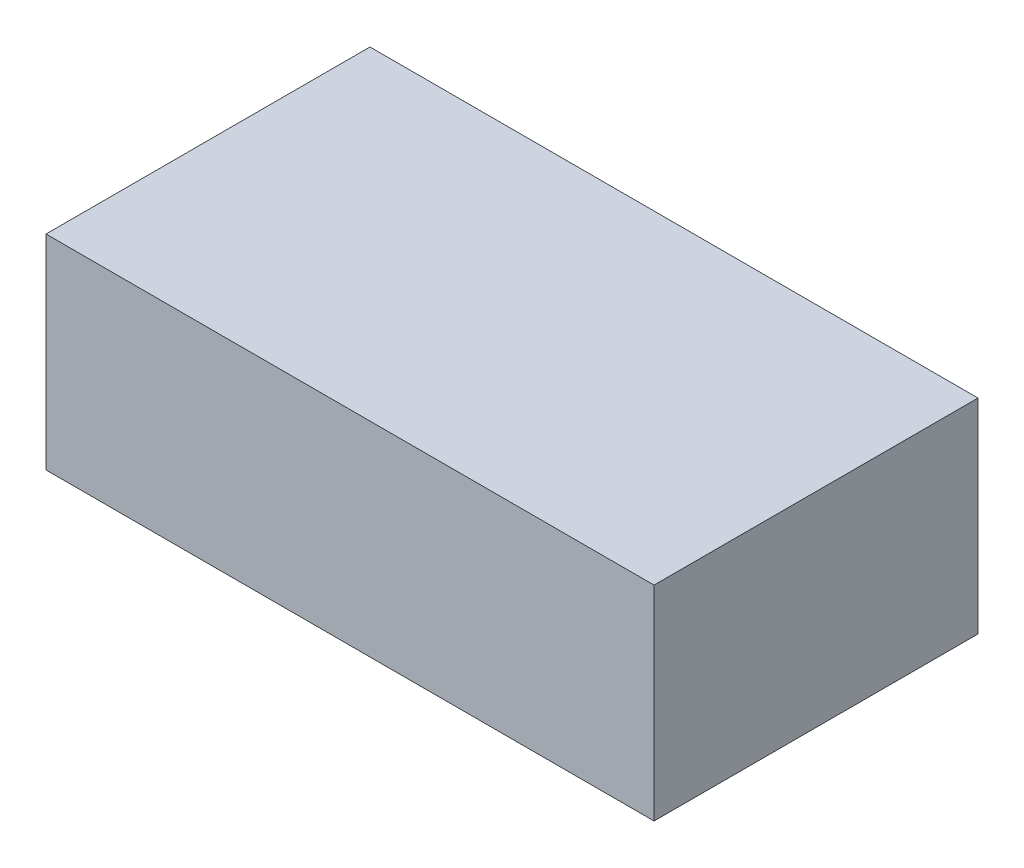
ISO-10303-21;
HEADER;
FILE_DESCRIPTION(('STEP AP214'),'2;1');
FILE_NAME('part.step','',(''),(''),'','','');
FILE_SCHEMA(('AUTOMOTIVE_DESIGN { 1 0 10303 214 1 1 1 1 }'));
ENDSEC;
DATA;
#1=APPLICATION_CONTEXT('core data for automotive mechanical design processes');
#2=APPLICATION_PROTOCOL_DEFINITION('international standard','automotive_design',2000,#1);
#3=PRODUCT_CONTEXT('',#1,'mechanical');
#4=PRODUCT('Part','Part','',(#3));
#5=PRODUCT_RELATED_PRODUCT_CATEGORY('part','',(#4));
#6=PRODUCT_DEFINITION_FORMATION('','',#4);
#7=PRODUCT_DEFINITION_CONTEXT('part definition',#1,'design');
#8=PRODUCT_DEFINITION('design','',#6,#7);
#9=PRODUCT_DEFINITION_SHAPE('','',#8);
#10=(LENGTH_UNIT() NAMED_UNIT(*) SI_UNIT(.MILLI.,.METRE.));
#11=(NAMED_UNIT(*) PLANE_ANGLE_UNIT() SI_UNIT($,.RADIAN.));
#12=(NAMED_UNIT(*) SI_UNIT($,.STERADIAN.) SOLID_ANGLE_UNIT());
#13=UNCERTAINTY_MEASURE_WITH_UNIT(LENGTH_MEASURE(1.E-05),#10,'distance_accuracy_value','');
#14=(GEOMETRIC_REPRESENTATION_CONTEXT(3) GLOBAL_UNCERTAINTY_ASSIGNED_CONTEXT((#13)) GLOBAL_UNIT_ASSIGNED_CONTEXT((#10,
#11,#12)) REPRESENTATION_CONTEXT('',''));
#15=CARTESIAN_POINT('',(0.,0.,0.));
#16=DIRECTION('',(0.,0.,1.));
#17=DIRECTION('',(1.,0.,0.));
#18=AXIS2_PLACEMENT_3D('',#15,#16,#17);
#19=CARTESIAN_POINT('',(61.,41.,-32.5));
#20=DIRECTION('',(-1.,0.,0.));
#21=DIRECTION('',(0.,0.,1.));
#22=AXIS2_PLACEMENT_3D('',#19,#20,#21);
#23=PLANE('',#22);
#24=DIRECTION('',(0.,0.,-1.));
#25=VECTOR('',#24,1.);
#26=CARTESIAN_POINT('',(61.,0.,-32.5));
#27=LINE('',#26,#25);
#28=CARTESIAN_POINT('',(61.,0.,32.5));
#29=VERTEX_POINT('',#28);
#30=CARTESIAN_POINT('',(61.,0.,-32.5));
#31=VERTEX_POINT('',#30);
#32=EDGE_CURVE('E96',#29,#31,#27,.T.);
#33=ORIENTED_EDGE('',*,*,#32,.T.);
#34=DIRECTION('',(0.,-1.,0.));
#35=VECTOR('',#34,1.);
#36=CARTESIAN_POINT('',(61.,41.,-32.5));
#37=LINE('',#36,#35);
#38=CARTESIAN_POINT('',(61.,41.,-32.5));
#39=VERTEX_POINT('',#38);
#40=EDGE_CURVE('E11',#39,#31,#37,.T.);
#41=ORIENTED_EDGE('',*,*,#40,.F.);
#42=DIRECTION('',(0.,0.,-1.));
#43=VECTOR('',#42,1.);
#44=CARTESIAN_POINT('',(61.,41.,-32.5));
#45=LINE('',#44,#43);
#46=CARTESIAN_POINT('',(61.,41.,32.5));
#47=VERTEX_POINT('',#46);
#48=EDGE_CURVE('E84',#47,#39,#45,.T.);
#49=ORIENTED_EDGE('',*,*,#48,.F.);
#50=DIRECTION('',(0.,-1.,0.));
#51=VECTOR('',#50,1.);
#52=CARTESIAN_POINT('',(61.,41.,32.5));
#53=LINE('',#52,#51);
#54=EDGE_CURVE('E92',#47,#29,#53,.T.);
#55=ORIENTED_EDGE('',*,*,#54,.T.);
#56=EDGE_LOOP('',(#33,#41,#49,#55));
#57=FACE_BOUND('',#56,.T.);
#58=ADVANCED_FACE('F33',(#57),#23,.F.);
#59=CARTESIAN_POINT('',(-61.,41.,-32.5));
#60=DIRECTION('',(0.,0.,1.));
#61=DIRECTION('',(1.,0.,0.));
#62=AXIS2_PLACEMENT_3D('',#59,#60,#61);
#63=PLANE('',#62);
#64=DIRECTION('',(-1.,0.,0.));
#65=VECTOR('',#64,1.);
#66=CARTESIAN_POINT('',(-61.,0.,-32.5));
#67=LINE('',#66,#65);
#68=CARTESIAN_POINT('',(-61.,0.,-32.5));
#69=VERTEX_POINT('',#68);
#70=EDGE_CURVE('E88',#31,#69,#67,.T.);
#71=ORIENTED_EDGE('',*,*,#70,.T.);
#72=DIRECTION('',(0.,-1.,0.));
#73=VECTOR('',#72,1.);
#74=CARTESIAN_POINT('',(-61.,41.,-32.5));
#75=LINE('',#74,#73);
#76=CARTESIAN_POINT('',(-61.,41.,-32.5));
#77=VERTEX_POINT('',#76);
#78=EDGE_CURVE('E41',#77,#69,#75,.T.);
#79=ORIENTED_EDGE('',*,*,#78,.F.);
#80=DIRECTION('',(-1.,0.,0.));
#81=VECTOR('',#80,1.);
#82=CARTESIAN_POINT('',(-61.,41.,-32.5));
#83=LINE('',#82,#81);
#84=EDGE_CURVE('E79',#39,#77,#83,.T.);
#85=ORIENTED_EDGE('',*,*,#84,.F.);
#86=ORIENTED_EDGE('',*,*,#40,.T.);
#87=EDGE_LOOP('',(#71,#79,#85,#86));
#88=FACE_BOUND('',#87,.T.);
#89=ADVANCED_FACE('F87',(#88),#63,.F.);
#90=CARTESIAN_POINT('',(-61.,41.,-32.5));
#91=DIRECTION('',(1.,0.,0.));
#92=DIRECTION('',(0.,0.,-1.));
#93=AXIS2_PLACEMENT_3D('',#90,#91,#92);
#94=PLANE('',#93);
#95=DIRECTION('',(0.,0.,1.));
#96=VECTOR('',#95,1.);
#97=CARTESIAN_POINT('',(-61.,0.,-32.5));
#98=LINE('',#97,#96);
#99=CARTESIAN_POINT('',(-61.,0.,32.5));
#100=VERTEX_POINT('',#99);
#101=EDGE_CURVE('E66',#69,#100,#98,.T.);
#102=ORIENTED_EDGE('',*,*,#101,.T.);
#103=DIRECTION('',(0.,-1.,0.));
#104=VECTOR('',#103,1.);
#105=CARTESIAN_POINT('',(-61.,41.,32.5));
#106=LINE('',#105,#104);
#107=CARTESIAN_POINT('',(-61.,41.,32.5));
#108=VERTEX_POINT('',#107);
#109=EDGE_CURVE('E89',#108,#100,#106,.T.);
#110=ORIENTED_EDGE('',*,*,#109,.F.);
#111=DIRECTION('',(0.,0.,1.));
#112=VECTOR('',#111,1.);
#113=CARTESIAN_POINT('',(-61.,41.,-32.5));
#114=LINE('',#113,#112);
#115=EDGE_CURVE('E82',#77,#108,#114,.T.);
#116=ORIENTED_EDGE('',*,*,#115,.F.);
#117=ORIENTED_EDGE('',*,*,#78,.T.);
#118=EDGE_LOOP('',(#102,#110,#116,#117));
#119=FACE_BOUND('',#118,.T.);
#120=ADVANCED_FACE('F90',(#119),#94,.F.);
#121=CARTESIAN_POINT('',(-61.,41.,32.5));
#122=DIRECTION('',(0.,0.,-1.));
#123=DIRECTION('',(-1.,0.,0.));
#124=AXIS2_PLACEMENT_3D('',#121,#122,#123);
#125=PLANE('',#124);
#126=DIRECTION('',(1.,0.,0.));
#127=VECTOR('',#126,1.);
#128=CARTESIAN_POINT('',(-61.,0.,32.5));
#129=LINE('',#128,#127);
#130=EDGE_CURVE('E72',#100,#29,#129,.T.);
#131=ORIENTED_EDGE('',*,*,#130,.T.);
#132=ORIENTED_EDGE('',*,*,#54,.F.);
#133=DIRECTION('',(1.,0.,0.));
#134=VECTOR('',#133,1.);
#135=CARTESIAN_POINT('',(-61.,41.,32.5));
#136=LINE('',#135,#134);
#137=EDGE_CURVE('E49',#108,#47,#136,.T.);
#138=ORIENTED_EDGE('',*,*,#137,.F.);
#139=ORIENTED_EDGE('',*,*,#109,.T.);
#140=EDGE_LOOP('',(#131,#132,#138,#139));
#141=FACE_BOUND('',#140,.T.);
#142=ADVANCED_FACE('F103',(#141),#125,.F.);
#143=CARTESIAN_POINT('',(0.,41.,0.));
#144=DIRECTION('',(0.,1.,0.));
#145=DIRECTION('',(0.,0.,1.));
#146=AXIS2_PLACEMENT_3D('',#143,#144,#145);
#147=PLANE('',#146);
#148=ORIENTED_EDGE('',*,*,#48,.T.);
#149=ORIENTED_EDGE('',*,*,#84,.T.);
#150=ORIENTED_EDGE('',*,*,#115,.T.);
#151=ORIENTED_EDGE('',*,*,#137,.T.);
#152=EDGE_LOOP('',(#148,#149,#150,#151));
#153=FACE_BOUND('',#152,.T.);
#154=ADVANCED_FACE('F80',(#153),#147,.T.);
#155=CARTESIAN_POINT('',(0.,0.,0.));
#156=DIRECTION('',(0.,1.,0.));
#157=DIRECTION('',(0.,0.,1.));
#158=AXIS2_PLACEMENT_3D('',#155,#156,#157);
#159=PLANE('',#158);
#160=ORIENTED_EDGE('',*,*,#32,.F.);
#161=ORIENTED_EDGE('',*,*,#130,.F.);
#162=ORIENTED_EDGE('',*,*,#101,.F.);
#163=ORIENTED_EDGE('',*,*,#70,.F.);
#164=EDGE_LOOP('',(#160,#161,#162,#163));
#165=FACE_BOUND('',#164,.T.);
#166=ADVANCED_FACE('F106',(#165),#159,.F.);
#167=CLOSED_SHELL('',(#58,#89,#120,#142,#154,#166));
#168=MANIFOLD_SOLID_BREP('B2',#167);
#169=ADVANCED_BREP_SHAPE_REPRESENTATION('',(#18,#168),#14);
#170=SHAPE_DEFINITION_REPRESENTATION(#9,#169);
ENDSEC;
END-ISO-10303-21;
